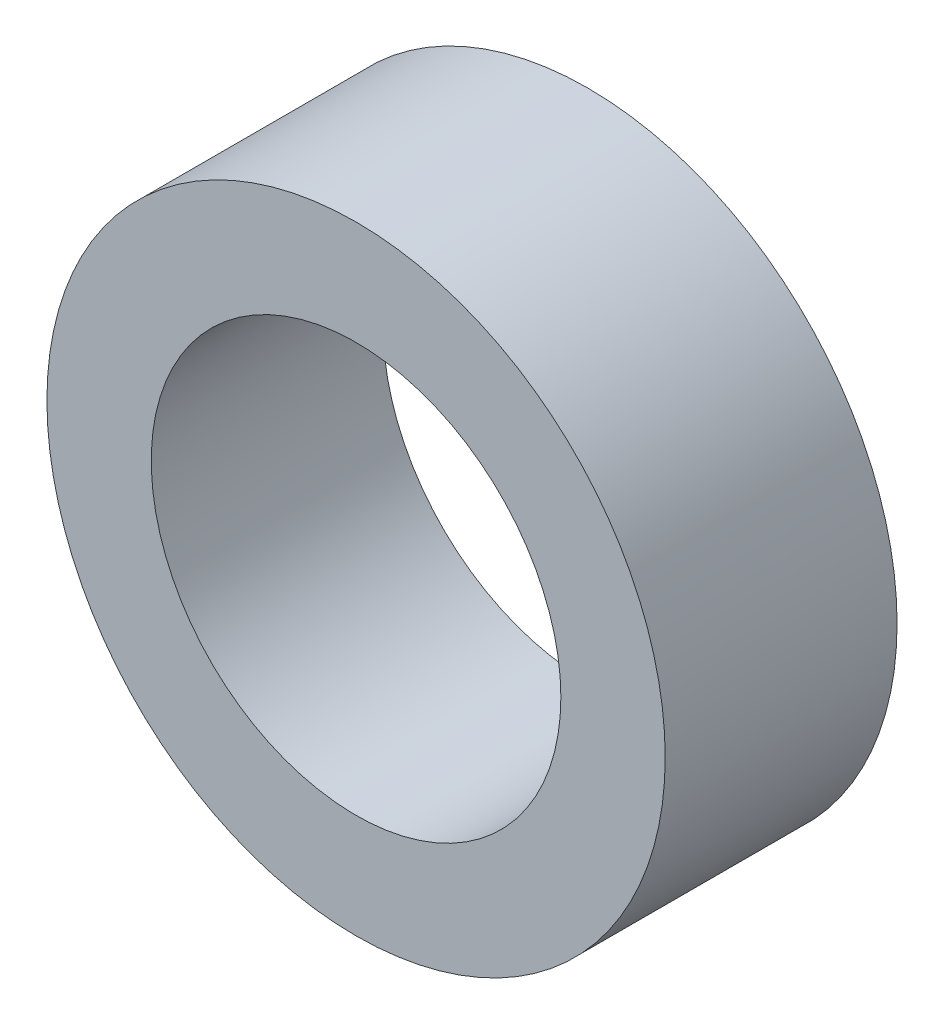
ISO-10303-21;
HEADER;
FILE_DESCRIPTION(('STEP AP214'),'2;1');
FILE_NAME('part.step','',(''),(''),'','','');
FILE_SCHEMA(('AUTOMOTIVE_DESIGN { 1 0 10303 214 1 1 1 1 }'));
ENDSEC;
DATA;
#1=APPLICATION_CONTEXT('core data for automotive mechanical design processes');
#2=APPLICATION_PROTOCOL_DEFINITION('international standard','automotive_design',2000,#1);
#3=PRODUCT_CONTEXT('',#1,'mechanical');
#4=PRODUCT('Part','Part','',(#3));
#5=PRODUCT_RELATED_PRODUCT_CATEGORY('part','',(#4));
#6=PRODUCT_DEFINITION_FORMATION('','',#4);
#7=PRODUCT_DEFINITION_CONTEXT('part definition',#1,'design');
#8=PRODUCT_DEFINITION('design','',#6,#7);
#9=PRODUCT_DEFINITION_SHAPE('','',#8);
#10=(LENGTH_UNIT() NAMED_UNIT(*) SI_UNIT(.MILLI.,.METRE.));
#11=(NAMED_UNIT(*) PLANE_ANGLE_UNIT() SI_UNIT($,.RADIAN.));
#12=(NAMED_UNIT(*) SI_UNIT($,.STERADIAN.) SOLID_ANGLE_UNIT());
#13=UNCERTAINTY_MEASURE_WITH_UNIT(LENGTH_MEASURE(1.E-05),#10,'distance_accuracy_value','');
#14=(GEOMETRIC_REPRESENTATION_CONTEXT(3) GLOBAL_UNCERTAINTY_ASSIGNED_CONTEXT((#13)) GLOBAL_UNIT_ASSIGNED_CONTEXT((#10,
#11,#12)) REPRESENTATION_CONTEXT('',''));
#15=CARTESIAN_POINT('',(0.,0.,0.));
#16=DIRECTION('',(0.,0.,1.));
#17=DIRECTION('',(1.,0.,0.));
#18=AXIS2_PLACEMENT_3D('',#15,#16,#17);
#19=CARTESIAN_POINT('',(0.,0.,1.5));
#20=DIRECTION('',(0.,0.,1.));
#21=DIRECTION('',(1.,0.,0.));
#22=AXIS2_PLACEMENT_3D('',#19,#20,#21);
#23=PLANE('',#22);
#24=CARTESIAN_POINT('',(0.,0.,1.5));
#25=DIRECTION('',(0.,0.,1.));
#26=DIRECTION('',(1.,0.,0.));
#27=AXIS2_PLACEMENT_3D('',#24,#25,#26);
#28=CIRCLE('',#27,4.);
#29=CARTESIAN_POINT('',(4.,0.,1.5));
#30=VERTEX_POINT('',#29);
#31=EDGE_CURVE('E10',#30,#30,#28,.T.);
#32=ORIENTED_EDGE('',*,*,#31,.T.);
#33=EDGE_LOOP('',(#32));
#34=FACE_BOUND('',#33,.T.);
#35=CARTESIAN_POINT('',(0.,0.,1.5));
#36=DIRECTION('',(0.,0.,1.));
#37=DIRECTION('',(1.,0.,0.));
#38=AXIS2_PLACEMENT_3D('',#35,#36,#37);
#39=CIRCLE('',#38,2.65);
#40=CARTESIAN_POINT('',(2.65,0.,1.5));
#41=VERTEX_POINT('',#40);
#42=EDGE_CURVE('E37',#41,#41,#39,.T.);
#43=ORIENTED_EDGE('',*,*,#42,.F.);
#44=EDGE_LOOP('',(#43));
#45=FACE_BOUND('',#44,.T.);
#46=ADVANCED_FACE('F30',(#34,#45),#23,.T.);
#47=CARTESIAN_POINT('',(0.,0.,1.5));
#48=DIRECTION('',(0.,0.,-1.));
#49=DIRECTION('',(-1.,0.,0.));
#50=AXIS2_PLACEMENT_3D('',#47,#48,#49);
#51=CYLINDRICAL_SURFACE('',#50,4.);
#52=ORIENTED_EDGE('',*,*,#31,.F.);
#53=EDGE_LOOP('',(#52));
#54=FACE_BOUND('',#53,.T.);
#55=CARTESIAN_POINT('',(0.,0.,-1.5));
#56=DIRECTION('',(0.,0.,1.));
#57=DIRECTION('',(1.,0.,0.));
#58=AXIS2_PLACEMENT_3D('',#55,#56,#57);
#59=CIRCLE('',#58,4.);
#60=CARTESIAN_POINT('',(4.,0.,-1.5));
#61=VERTEX_POINT('',#60);
#62=EDGE_CURVE('E41',#61,#61,#59,.T.);
#63=ORIENTED_EDGE('',*,*,#62,.T.);
#64=EDGE_LOOP('',(#63));
#65=FACE_BOUND('',#64,.T.);
#66=ADVANCED_FACE('F32',(#54,#65),#51,.T.);
#67=CARTESIAN_POINT('',(0.,0.,1.5));
#68=DIRECTION('',(0.,0.,-1.));
#69=DIRECTION('',(-1.,0.,0.));
#70=AXIS2_PLACEMENT_3D('',#67,#68,#69);
#71=CYLINDRICAL_SURFACE('',#70,2.65);
#72=ORIENTED_EDGE('',*,*,#42,.T.);
#73=EDGE_LOOP('',(#72));
#74=FACE_BOUND('',#73,.T.);
#75=CARTESIAN_POINT('',(0.,0.,-1.5));
#76=DIRECTION('',(0.,0.,1.));
#77=DIRECTION('',(1.,0.,0.));
#78=AXIS2_PLACEMENT_3D('',#75,#76,#77);
#79=CIRCLE('',#78,2.65);
#80=CARTESIAN_POINT('',(2.65,0.,-1.5));
#81=VERTEX_POINT('',#80);
#82=EDGE_CURVE('E45',#81,#81,#79,.T.);
#83=ORIENTED_EDGE('',*,*,#82,.F.);
#84=EDGE_LOOP('',(#83));
#85=FACE_BOUND('',#84,.T.);
#86=ADVANCED_FACE('F54',(#74,#85),#71,.F.);
#87=CARTESIAN_POINT('',(0.,0.,-1.5));
#88=DIRECTION('',(0.,0.,1.));
#89=DIRECTION('',(1.,0.,0.));
#90=AXIS2_PLACEMENT_3D('',#87,#88,#89);
#91=PLANE('',#90);
#92=ORIENTED_EDGE('',*,*,#82,.T.);
#93=EDGE_LOOP('',(#92));
#94=FACE_BOUND('',#93,.T.);
#95=ORIENTED_EDGE('',*,*,#62,.F.);
#96=EDGE_LOOP('',(#95));
#97=FACE_BOUND('',#96,.T.);
#98=ADVANCED_FACE('F51',(#94,#97),#91,.F.);
#99=CLOSED_SHELL('',(#46,#66,#86,#98));
#100=MANIFOLD_SOLID_BREP('B2',#99);
#101=ADVANCED_BREP_SHAPE_REPRESENTATION('',(#18,#100),#14);
#102=SHAPE_DEFINITION_REPRESENTATION(#9,#101);
ENDSEC;
END-ISO-10303-21;
